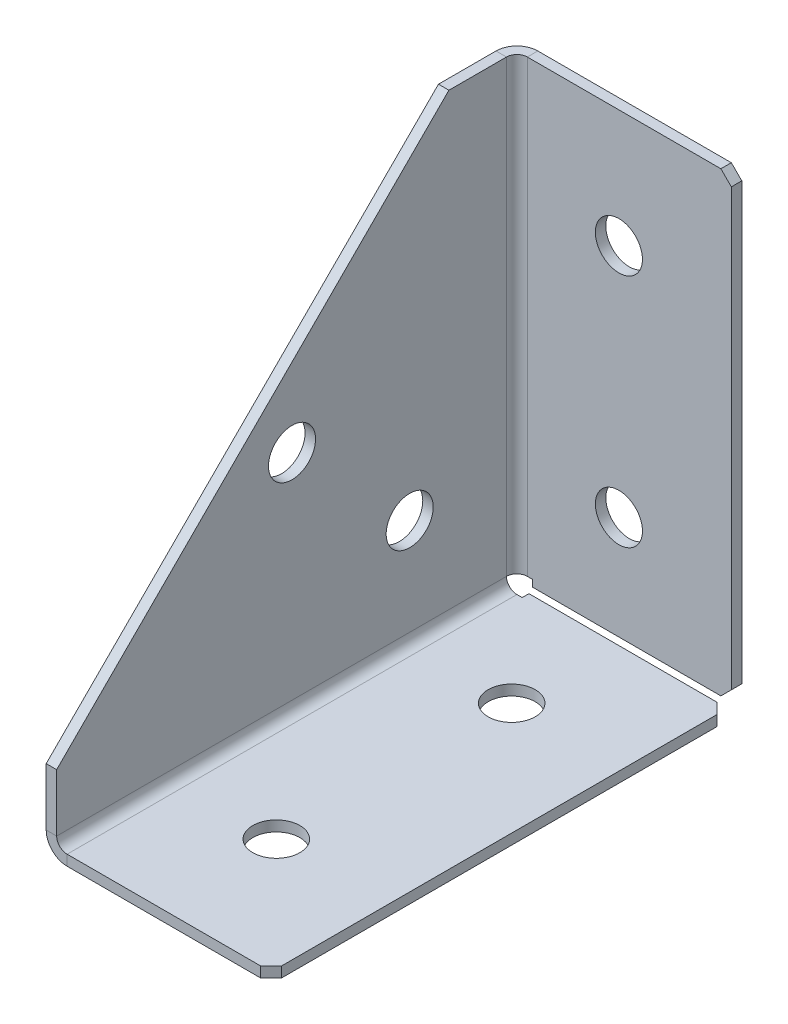
ISO-10303-21;
HEADER;
FILE_DESCRIPTION(('STEP AP214'),'2;1');
FILE_NAME('part.step','',(''),(''),'','','');
FILE_SCHEMA(('AUTOMOTIVE_DESIGN { 1 0 10303 214 1 1 1 1 }'));
ENDSEC;
DATA;
#1=APPLICATION_CONTEXT('core data for automotive mechanical design processes');
#2=APPLICATION_PROTOCOL_DEFINITION('international standard','automotive_design',2000,#1);
#3=PRODUCT_CONTEXT('',#1,'mechanical');
#4=PRODUCT('Part','Part','',(#3));
#5=PRODUCT_RELATED_PRODUCT_CATEGORY('part','',(#4));
#6=PRODUCT_DEFINITION_FORMATION('','',#4);
#7=PRODUCT_DEFINITION_CONTEXT('part definition',#1,'design');
#8=PRODUCT_DEFINITION('design','',#6,#7);
#9=PRODUCT_DEFINITION_SHAPE('','',#8);
#10=(LENGTH_UNIT() NAMED_UNIT(*) SI_UNIT(.MILLI.,.METRE.));
#11=(NAMED_UNIT(*) PLANE_ANGLE_UNIT() SI_UNIT($,.RADIAN.));
#12=(NAMED_UNIT(*) SI_UNIT($,.STERADIAN.) SOLID_ANGLE_UNIT());
#13=UNCERTAINTY_MEASURE_WITH_UNIT(LENGTH_MEASURE(1.E-05),#10,'distance_accuracy_value','');
#14=(GEOMETRIC_REPRESENTATION_CONTEXT(3) GLOBAL_UNCERTAINTY_ASSIGNED_CONTEXT((#13)) GLOBAL_UNIT_ASSIGNED_CONTEXT((#10,
#11,#12)) REPRESENTATION_CONTEXT('',''));
#15=CARTESIAN_POINT('',(0.,0.,0.));
#16=DIRECTION('',(0.,0.,1.));
#17=DIRECTION('',(1.,0.,0.));
#18=AXIS2_PLACEMENT_3D('',#15,#16,#17);
#19=CARTESIAN_POINT('',(4.,4.,3.99999999999998));
#20=DIRECTION('',(0.,0.,1.));
#21=DIRECTION('',(1.,0.,0.));
#22=AXIS2_PLACEMENT_3D('',#19,#20,#21);
#23=PLANE('',#22);
#24=DIRECTION('',(-1.,0.,0.));
#25=VECTOR('',#24,1.);
#26=CARTESIAN_POINT('',(0.,3.99999999999997,3.99999999999997));
#27=LINE('',#26,#25);
#28=CARTESIAN_POINT('',(2.,3.99999999999997,3.99999999999999));
#29=VERTEX_POINT('',#28);
#30=CARTESIAN_POINT('',(0.,3.99999999999997,3.99999999999997));
#31=VERTEX_POINT('',#30);
#32=EDGE_CURVE('E402',#29,#31,#27,.T.);
#33=ORIENTED_EDGE('',*,*,#32,.F.);
#34=CARTESIAN_POINT('',(4.,4.,3.99999999999998));
#35=DIRECTION('',(0.,0.,-1.));
#36=DIRECTION('',(-1.,0.,0.));
#37=AXIS2_PLACEMENT_3D('',#34,#35,#36);
#38=CIRCLE('',#37,2.);
#39=CARTESIAN_POINT('',(4.,2.,3.99999999999998));
#40=VERTEX_POINT('',#39);
#41=EDGE_CURVE('E347',#29,#40,#38,.F.);
#42=ORIENTED_EDGE('',*,*,#41,.T.);
#43=DIRECTION('',(0.,-1.,0.));
#44=VECTOR('',#43,1.);
#45=CARTESIAN_POINT('',(4.,0.,3.99999999999998));
#46=LINE('',#45,#44);
#47=CARTESIAN_POINT('',(4.,0.,3.99999999999998));
#48=VERTEX_POINT('',#47);
#49=EDGE_CURVE('E399',#40,#48,#46,.T.);
#50=ORIENTED_EDGE('',*,*,#49,.T.);
#51=CARTESIAN_POINT('',(4.,4.,3.99999999999998));
#52=DIRECTION('',(0.,0.,-1.));
#53=DIRECTION('',(-1.,0.,0.));
#54=AXIS2_PLACEMENT_3D('',#51,#52,#53);
#55=CIRCLE('',#54,4.);
#56=EDGE_CURVE('E286',#31,#48,#55,.F.);
#57=ORIENTED_EDGE('',*,*,#56,.F.);
#58=EDGE_LOOP('',(#33,#42,#50,#57));
#59=FACE_BOUND('',#58,.T.);
#60=ADVANCED_FACE('F48',(#59),#23,.F.);
#61=CARTESIAN_POINT('',(43.,0.,3.99999999999998));
#62=DIRECTION('',(0.,0.,1.));
#63=DIRECTION('',(1.,0.,0.));
#64=AXIS2_PLACEMENT_3D('',#61,#62,#63);
#65=PLANE('',#64);
#66=ORIENTED_EDGE('',*,*,#49,.F.);
#67=DIRECTION('',(1.,0.,0.));
#68=VECTOR('',#67,1.);
#69=CARTESIAN_POINT('',(43.,2.,3.99999999999998));
#70=LINE('',#69,#68);
#71=CARTESIAN_POINT('',(5.010401,2.,3.99999999999998));
#72=VERTEX_POINT('',#71);
#73=EDGE_CURVE('E317',#40,#72,#70,.T.);
#74=ORIENTED_EDGE('',*,*,#73,.T.);
#75=DIRECTION('',(0.,-1.,0.));
#76=VECTOR('',#75,1.);
#77=CARTESIAN_POINT('',(5.010401,0.,3.99999999999998));
#78=LINE('',#77,#76);
#79=CARTESIAN_POINT('',(5.010401,0.,3.99999999999998));
#80=VERTEX_POINT('',#79);
#81=EDGE_CURVE('E396',#72,#80,#78,.T.);
#82=ORIENTED_EDGE('',*,*,#81,.T.);
#83=DIRECTION('',(1.,0.,0.));
#84=VECTOR('',#83,1.);
#85=CARTESIAN_POINT('',(43.,0.,3.99999999999998));
#86=LINE('',#85,#84);
#87=EDGE_CURVE('E250',#48,#80,#86,.T.);
#88=ORIENTED_EDGE('',*,*,#87,.F.);
#89=EDGE_LOOP('',(#66,#74,#82,#88));
#90=FACE_BOUND('',#89,.T.);
#91=ADVANCED_FACE('F520',(#90),#65,.F.);
#92=CARTESIAN_POINT('',(5.010401,0.,90.));
#93=DIRECTION('',(-1.,0.,0.));
#94=DIRECTION('',(0.,0.,1.));
#95=AXIS2_PLACEMENT_3D('',#92,#93,#94);
#96=PLANE('',#95);
#97=ORIENTED_EDGE('',*,*,#81,.F.);
#98=DIRECTION('',(0.,0.,1.));
#99=VECTOR('',#98,1.);
#100=CARTESIAN_POINT('',(5.010401,2.,90.));
#101=LINE('',#100,#99);
#102=CARTESIAN_POINT('',(5.010401,2.,2.70710678118655));
#103=VERTEX_POINT('',#102);
#104=EDGE_CURVE('E357',#103,#72,#101,.T.);
#105=ORIENTED_EDGE('',*,*,#104,.F.);
#106=DIRECTION('',(0.,-1.,0.));
#107=VECTOR('',#106,1.);
#108=CARTESIAN_POINT('',(5.010401,0.,2.70710678118655));
#109=LINE('',#108,#107);
#110=CARTESIAN_POINT('',(5.010401,0.,2.70710678118655));
#111=VERTEX_POINT('',#110);
#112=EDGE_CURVE('E393',#103,#111,#109,.T.);
#113=ORIENTED_EDGE('',*,*,#112,.T.);
#114=DIRECTION('',(0.,0.,1.));
#115=VECTOR('',#114,1.);
#116=CARTESIAN_POINT('',(5.010401,0.,90.));
#117=LINE('',#116,#115);
#118=EDGE_CURVE('E246',#111,#80,#117,.T.);
#119=ORIENTED_EDGE('',*,*,#118,.T.);
#120=EDGE_LOOP('',(#97,#105,#113,#119));
#121=FACE_BOUND('',#120,.T.);
#122=ADVANCED_FACE('F525',(#121),#96,.T.);
#123=CARTESIAN_POINT('',(43.,0.,2.70710678118655));
#124=DIRECTION('',(0.,0.,1.));
#125=DIRECTION('',(1.,0.,0.));
#126=AXIS2_PLACEMENT_3D('',#123,#124,#125);
#127=PLANE('',#126);
#128=DIRECTION('',(1.,0.,0.));
#129=VECTOR('',#128,1.);
#130=CARTESIAN_POINT('',(43.,2.,2.70710678118655));
#131=LINE('',#130,#129);
#132=CARTESIAN_POINT('',(41.,2.,2.70710678118655));
#133=VERTEX_POINT('',#132);
#134=EDGE_CURVE('E321',#103,#133,#131,.T.);
#135=ORIENTED_EDGE('',*,*,#134,.T.);
#136=DIRECTION('',(0.,1.,0.));
#137=VECTOR('',#136,1.);
#138=CARTESIAN_POINT('',(41.,0.,2.70710678118655));
#139=LINE('',#138,#137);
#140=CARTESIAN_POINT('',(41.,0.,2.70710678118655));
#141=VERTEX_POINT('',#140);
#142=EDGE_CURVE('E429',#133,#141,#139,.F.);
#143=ORIENTED_EDGE('',*,*,#142,.T.);
#144=DIRECTION('',(1.,0.,0.));
#145=VECTOR('',#144,1.);
#146=CARTESIAN_POINT('',(43.,0.,2.70710678118655));
#147=LINE('',#146,#145);
#148=EDGE_CURVE('E242',#111,#141,#147,.T.);
#149=ORIENTED_EDGE('',*,*,#148,.F.);
#150=ORIENTED_EDGE('',*,*,#112,.F.);
#151=EDGE_LOOP('',(#135,#143,#149,#150));
#152=FACE_BOUND('',#151,.T.);
#153=ADVANCED_FACE('F562',(#152),#127,.F.);
#154=CARTESIAN_POINT('',(43.,0.,90.));
#155=DIRECTION('',(1.,0.,0.));
#156=DIRECTION('',(0.,0.,-1.));
#157=AXIS2_PLACEMENT_3D('',#154,#155,#156);
#158=PLANE('',#157);
#159=DIRECTION('',(0.,0.,1.));
#160=VECTOR('',#159,1.);
#161=CARTESIAN_POINT('',(43.,2.,90.));
#162=LINE('',#161,#160);
#163=CARTESIAN_POINT('',(43.,2.,88.));
#164=VERTEX_POINT('',#163);
#165=CARTESIAN_POINT('',(43.,2.,4.70710678118656));
#166=VERTEX_POINT('',#165);
#167=EDGE_CURVE('E350',#164,#166,#162,.F.);
#168=ORIENTED_EDGE('',*,*,#167,.F.);
#169=DIRECTION('',(0.,-1.,0.));
#170=VECTOR('',#169,1.);
#171=CARTESIAN_POINT('',(43.,0.,88.));
#172=LINE('',#171,#170);
#173=CARTESIAN_POINT('',(43.,0.,88.));
#174=VERTEX_POINT('',#173);
#175=EDGE_CURVE('E410',#164,#174,#172,.T.);
#176=ORIENTED_EDGE('',*,*,#175,.T.);
#177=DIRECTION('',(0.,0.,-1.));
#178=VECTOR('',#177,1.);
#179=CARTESIAN_POINT('',(43.,0.,90.));
#180=LINE('',#179,#178);
#181=CARTESIAN_POINT('',(43.,0.,4.70710678118659));
#182=VERTEX_POINT('',#181);
#183=EDGE_CURVE('E279',#174,#182,#180,.T.);
#184=ORIENTED_EDGE('',*,*,#183,.T.);
#185=DIRECTION('',(0.,1.,0.));
#186=VECTOR('',#185,1.);
#187=CARTESIAN_POINT('',(43.,0.,4.70710678118656));
#188=LINE('',#187,#186);
#189=EDGE_CURVE('E405',#182,#166,#188,.T.);
#190=ORIENTED_EDGE('',*,*,#189,.T.);
#191=EDGE_LOOP('',(#168,#176,#184,#190));
#192=FACE_BOUND('',#191,.T.);
#193=ADVANCED_FACE('F576',(#192),#158,.T.);
#194=CARTESIAN_POINT('',(43.,0.,90.));
#195=DIRECTION('',(0.,0.,-1.));
#196=DIRECTION('',(-1.,0.,0.));
#197=AXIS2_PLACEMENT_3D('',#194,#195,#196);
#198=PLANE('',#197);
#199=DIRECTION('',(-1.,0.,0.));
#200=VECTOR('',#199,1.);
#201=CARTESIAN_POINT('',(43.,0.,90.));
#202=LINE('',#201,#200);
#203=CARTESIAN_POINT('',(41.,0.,90.));
#204=VERTEX_POINT('',#203);
#205=CARTESIAN_POINT('',(4.,0.,90.));
#206=VERTEX_POINT('',#205);
#207=EDGE_CURVE('E220',#204,#206,#202,.T.);
#208=ORIENTED_EDGE('',*,*,#207,.F.);
#209=DIRECTION('',(0.,-1.,0.));
#210=VECTOR('',#209,1.);
#211=CARTESIAN_POINT('',(41.,0.,90.));
#212=LINE('',#211,#210);
#213=CARTESIAN_POINT('',(41.,2.,90.));
#214=VERTEX_POINT('',#213);
#215=EDGE_CURVE('E420',#204,#214,#212,.F.);
#216=ORIENTED_EDGE('',*,*,#215,.T.);
#217=DIRECTION('',(1.,0.,0.));
#218=VECTOR('',#217,1.);
#219=CARTESIAN_POINT('',(43.,2.,90.));
#220=LINE('',#219,#218);
#221=CARTESIAN_POINT('',(4.,2.,90.));
#222=VERTEX_POINT('',#221);
#223=EDGE_CURVE('E343',#214,#222,#220,.F.);
#224=ORIENTED_EDGE('',*,*,#223,.T.);
#225=DIRECTION('',(0.,-1.,0.));
#226=VECTOR('',#225,1.);
#227=CARTESIAN_POINT('',(4.,0.,90.));
#228=LINE('',#227,#226);
#229=EDGE_CURVE('E389',#222,#206,#228,.T.);
#230=ORIENTED_EDGE('',*,*,#229,.T.);
#231=EDGE_LOOP('',(#208,#216,#224,#230));
#232=FACE_BOUND('',#231,.T.);
#233=ADVANCED_FACE('F714',(#232),#198,.F.);
#234=CARTESIAN_POINT('',(4.,4.,90.));
#235=DIRECTION('',(0.,0.,1.));
#236=DIRECTION('',(1.,0.,0.));
#237=AXIS2_PLACEMENT_3D('',#234,#235,#236);
#238=PLANE('',#237);
#239=ORIENTED_EDGE('',*,*,#229,.F.);
#240=CARTESIAN_POINT('',(4.,4.,90.));
#241=DIRECTION('',(0.,0.,-1.));
#242=DIRECTION('',(-1.,0.,0.));
#243=AXIS2_PLACEMENT_3D('',#240,#241,#242);
#244=CIRCLE('',#243,2.);
#245=CARTESIAN_POINT('',(2.,4.,90.));
#246=VERTEX_POINT('',#245);
#247=EDGE_CURVE('E334',#222,#246,#244,.T.);
#248=ORIENTED_EDGE('',*,*,#247,.T.);
#249=DIRECTION('',(-1.,0.,0.));
#250=VECTOR('',#249,1.);
#251=CARTESIAN_POINT('',(0.,4.,90.));
#252=LINE('',#251,#250);
#253=CARTESIAN_POINT('',(0.,4.,90.));
#254=VERTEX_POINT('',#253);
#255=EDGE_CURVE('E207',#246,#254,#252,.T.);
#256=ORIENTED_EDGE('',*,*,#255,.T.);
#257=CARTESIAN_POINT('',(4.,4.,90.));
#258=DIRECTION('',(0.,0.,-1.));
#259=DIRECTION('',(-1.,0.,0.));
#260=AXIS2_PLACEMENT_3D('',#257,#258,#259);
#261=CIRCLE('',#260,4.);
#262=EDGE_CURVE('E275',#206,#254,#261,.T.);
#263=ORIENTED_EDGE('',*,*,#262,.F.);
#264=EDGE_LOOP('',(#239,#248,#256,#263));
#265=FACE_BOUND('',#264,.T.);
#266=ADVANCED_FACE('F493',(#265),#238,.T.);
#267=CARTESIAN_POINT('',(0.,15.,90.));
#268=DIRECTION('',(0.,0.,1.));
#269=DIRECTION('',(0.,-1.,0.));
#270=AXIS2_PLACEMENT_3D('',#267,#268,#269);
#271=PLANE('',#270);
#272=ORIENTED_EDGE('',*,*,#255,.F.);
#273=DIRECTION('',(0.,1.,0.));
#274=VECTOR('',#273,1.);
#275=CARTESIAN_POINT('',(2.,0.,90.));
#276=LINE('',#275,#274);
#277=CARTESIAN_POINT('',(2.,15.,90.));
#278=VERTEX_POINT('',#277);
#279=EDGE_CURVE('E201',#278,#246,#276,.F.);
#280=ORIENTED_EDGE('',*,*,#279,.F.);
#281=DIRECTION('',(-1.,0.,0.));
#282=VECTOR('',#281,1.);
#283=CARTESIAN_POINT('',(0.,15.,90.));
#284=LINE('',#283,#282);
#285=CARTESIAN_POINT('',(0.,15.,90.));
#286=VERTEX_POINT('',#285);
#287=EDGE_CURVE('E195',#278,#286,#284,.T.);
#288=ORIENTED_EDGE('',*,*,#287,.T.);
#289=DIRECTION('',(0.,-1.,0.));
#290=VECTOR('',#289,1.);
#291=CARTESIAN_POINT('',(0.,15.,90.));
#292=LINE('',#291,#290);
#293=EDGE_CURVE('E198',#286,#254,#292,.T.);
#294=ORIENTED_EDGE('',*,*,#293,.T.);
#295=EDGE_LOOP('',(#272,#280,#288,#294));
#296=FACE_BOUND('',#295,.T.);
#297=ADVANCED_FACE('F197',(#296),#271,.T.);
#298=CARTESIAN_POINT('',(0.,90.,15.));
#299=DIRECTION('',(0.,0.707106781186548,0.707106781186548));
#300=DIRECTION('',(0.,-0.707106781186548,0.707106781186548));
#301=AXIS2_PLACEMENT_3D('',#298,#299,#300);
#302=PLANE('',#301);
#303=ORIENTED_EDGE('',*,*,#287,.F.);
#304=DIRECTION('',(0.,-0.707106781186548,0.707106781186548));
#305=VECTOR('',#304,1.);
#306=CARTESIAN_POINT('',(2.,90.,15.));
#307=LINE('',#306,#305);
#308=CARTESIAN_POINT('',(2.,90.,15.));
#309=VERTEX_POINT('',#308);
#310=EDGE_CURVE('E338',#309,#278,#307,.T.);
#311=ORIENTED_EDGE('',*,*,#310,.F.);
#312=DIRECTION('',(-1.,0.,0.));
#313=VECTOR('',#312,1.);
#314=CARTESIAN_POINT('',(0.,90.,15.));
#315=LINE('',#314,#313);
#316=CARTESIAN_POINT('',(0.,90.,15.));
#317=VERTEX_POINT('',#316);
#318=EDGE_CURVE('E208',#309,#317,#315,.T.);
#319=ORIENTED_EDGE('',*,*,#318,.T.);
#320=DIRECTION('',(0.,-0.707106781186548,0.707106781186548));
#321=VECTOR('',#320,1.);
#322=CARTESIAN_POINT('',(0.,90.,15.));
#323=LINE('',#322,#321);
#324=EDGE_CURVE('E215',#317,#286,#323,.T.);
#325=ORIENTED_EDGE('',*,*,#324,.T.);
#326=EDGE_LOOP('',(#303,#311,#319,#325));
#327=FACE_BOUND('',#326,.T.);
#328=ADVANCED_FACE('F222',(#327),#302,.T.);
#329=CARTESIAN_POINT('',(0.,90.,0.));
#330=DIRECTION('',(0.,1.,0.));
#331=DIRECTION('',(0.,0.,1.));
#332=AXIS2_PLACEMENT_3D('',#329,#330,#331);
#333=PLANE('',#332);
#334=ORIENTED_EDGE('',*,*,#318,.F.);
#335=DIRECTION('',(0.,0.,-1.));
#336=VECTOR('',#335,1.);
#337=CARTESIAN_POINT('',(2.,90.,0.));
#338=LINE('',#337,#336);
#339=CARTESIAN_POINT('',(2.,90.,4.));
#340=VERTEX_POINT('',#339);
#341=EDGE_CURVE('E328',#340,#309,#338,.F.);
#342=ORIENTED_EDGE('',*,*,#341,.F.);
#343=DIRECTION('',(-1.,0.,0.));
#344=VECTOR('',#343,1.);
#345=CARTESIAN_POINT('',(0.,90.,4.));
#346=LINE('',#345,#344);
#347=CARTESIAN_POINT('',(0.,90.,4.));
#348=VERTEX_POINT('',#347);
#349=EDGE_CURVE('E382',#340,#348,#346,.T.);
#350=ORIENTED_EDGE('',*,*,#349,.T.);
#351=DIRECTION('',(0.,0.,1.));
#352=VECTOR('',#351,1.);
#353=CARTESIAN_POINT('',(0.,90.,0.));
#354=LINE('',#353,#352);
#355=EDGE_CURVE('E224',#348,#317,#354,.T.);
#356=ORIENTED_EDGE('',*,*,#355,.T.);
#357=EDGE_LOOP('',(#334,#342,#350,#356));
#358=FACE_BOUND('',#357,.T.);
#359=ADVANCED_FACE('F505',(#358),#333,.T.);
#360=CARTESIAN_POINT('',(4.,90.,4.));
#361=DIRECTION('',(0.,-1.,0.));
#362=DIRECTION('',(0.,0.,-1.));
#363=AXIS2_PLACEMENT_3D('',#360,#361,#362);
#364=PLANE('',#363);
#365=ORIENTED_EDGE('',*,*,#349,.F.);
#366=CARTESIAN_POINT('',(4.,90.,4.));
#367=DIRECTION('',(0.,1.,0.));
#368=DIRECTION('',(0.,0.,1.));
#369=AXIS2_PLACEMENT_3D('',#366,#367,#368);
#370=CIRCLE('',#369,2.);
#371=CARTESIAN_POINT('',(4.,90.,2.));
#372=VERTEX_POINT('',#371);
#373=EDGE_CURVE('E329',#340,#372,#370,.F.);
#374=ORIENTED_EDGE('',*,*,#373,.T.);
#375=DIRECTION('',(0.,0.,-1.));
#376=VECTOR('',#375,1.);
#377=CARTESIAN_POINT('',(4.,90.,0.));
#378=LINE('',#377,#376);
#379=CARTESIAN_POINT('',(4.,90.,0.));
#380=VERTEX_POINT('',#379);
#381=EDGE_CURVE('E378',#372,#380,#378,.T.);
#382=ORIENTED_EDGE('',*,*,#381,.T.);
#383=CARTESIAN_POINT('',(4.,90.,4.));
#384=DIRECTION('',(0.,1.,0.));
#385=DIRECTION('',(0.,0.,1.));
#386=AXIS2_PLACEMENT_3D('',#383,#384,#385);
#387=CIRCLE('',#386,4.);
#388=EDGE_CURVE('E270',#348,#380,#387,.F.);
#389=ORIENTED_EDGE('',*,*,#388,.F.);
#390=EDGE_LOOP('',(#365,#374,#382,#389));
#391=FACE_BOUND('',#390,.T.);
#392=ADVANCED_FACE('F507',(#391),#364,.F.);
#393=CARTESIAN_POINT('',(43.,90.,0.));
#394=DIRECTION('',(0.,1.,0.));
#395=DIRECTION('',(-1.,0.,0.));
#396=AXIS2_PLACEMENT_3D('',#393,#394,#395);
#397=PLANE('',#396);
#398=DIRECTION('',(1.,0.,0.));
#399=VECTOR('',#398,1.);
#400=CARTESIAN_POINT('',(43.,90.,2.));
#401=LINE('',#400,#399);
#402=CARTESIAN_POINT('',(41.,90.,2.));
#403=VERTEX_POINT('',#402);
#404=EDGE_CURVE('E325',#403,#372,#401,.F.);
#405=ORIENTED_EDGE('',*,*,#404,.F.);
#406=DIRECTION('',(0.,0.,-1.));
#407=VECTOR('',#406,1.);
#408=CARTESIAN_POINT('',(41.,90.,0.));
#409=LINE('',#408,#407);
#410=CARTESIAN_POINT('',(41.,90.,0.));
#411=VERTEX_POINT('',#410);
#412=EDGE_CURVE('E11',#403,#411,#409,.T.);
#413=ORIENTED_EDGE('',*,*,#412,.T.);
#414=DIRECTION('',(-1.,0.,0.));
#415=VECTOR('',#414,1.);
#416=CARTESIAN_POINT('',(43.,90.,0.));
#417=LINE('',#416,#415);
#418=EDGE_CURVE('E229',#411,#380,#417,.T.);
#419=ORIENTED_EDGE('',*,*,#418,.T.);
#420=ORIENTED_EDGE('',*,*,#381,.F.);
#421=EDGE_LOOP('',(#405,#413,#419,#420));
#422=FACE_BOUND('',#421,.T.);
#423=ADVANCED_FACE('F511',(#422),#397,.T.);
#424=CARTESIAN_POINT('',(43.,0.,0.));
#425=DIRECTION('',(1.,0.,0.));
#426=DIRECTION('',(0.,1.,0.));
#427=AXIS2_PLACEMENT_3D('',#424,#425,#426);
#428=PLANE('',#427);
#429=DIRECTION('',(0.,1.,0.));
#430=VECTOR('',#429,1.);
#431=CARTESIAN_POINT('',(43.,0.,2.));
#432=LINE('',#431,#430);
#433=CARTESIAN_POINT('',(43.,4.70710678118654,2.));
#434=VERTEX_POINT('',#433);
#435=CARTESIAN_POINT('',(43.,88.,2.));
#436=VERTEX_POINT('',#435);
#437=EDGE_CURVE('E322',#434,#436,#432,.T.);
#438=ORIENTED_EDGE('',*,*,#437,.F.);
#439=DIRECTION('',(0.,0.,-1.));
#440=VECTOR('',#439,1.);
#441=CARTESIAN_POINT('',(43.,4.70710678118654,0.));
#442=LINE('',#441,#440);
#443=CARTESIAN_POINT('',(43.,4.70710678118653,0.));
#444=VERTEX_POINT('',#443);
#445=EDGE_CURVE('E436',#434,#444,#442,.T.);
#446=ORIENTED_EDGE('',*,*,#445,.T.);
#447=DIRECTION('',(0.,1.,0.));
#448=VECTOR('',#447,1.);
#449=CARTESIAN_POINT('',(43.,0.,0.));
#450=LINE('',#449,#448);
#451=CARTESIAN_POINT('',(43.,88.,0.));
#452=VERTEX_POINT('',#451);
#453=EDGE_CURVE('E235',#444,#452,#450,.T.);
#454=ORIENTED_EDGE('',*,*,#453,.T.);
#455=DIRECTION('',(0.,0.,1.));
#456=VECTOR('',#455,1.);
#457=CARTESIAN_POINT('',(43.,88.,0.));
#458=LINE('',#457,#456);
#459=EDGE_CURVE('E433',#452,#436,#458,.T.);
#460=ORIENTED_EDGE('',*,*,#459,.T.);
#461=EDGE_LOOP('',(#438,#446,#454,#460));
#462=FACE_BOUND('',#461,.T.);
#463=ADVANCED_FACE('F458',(#462),#428,.T.);
#464=CARTESIAN_POINT('',(43.,2.70710678118655,0.));
#465=DIRECTION('',(0.,1.,0.));
#466=DIRECTION('',(-1.,0.,0.));
#467=AXIS2_PLACEMENT_3D('',#464,#465,#466);
#468=PLANE('',#467);
#469=DIRECTION('',(-1.,0.,0.));
#470=VECTOR('',#469,1.);
#471=CARTESIAN_POINT('',(43.,2.70710678118655,0.));
#472=LINE('',#471,#470);
#473=CARTESIAN_POINT('',(41.,2.70710678118655,0.));
#474=VERTEX_POINT('',#473);
#475=CARTESIAN_POINT('',(5.010401,2.70710678118655,0.));
#476=VERTEX_POINT('',#475);
#477=EDGE_CURVE('E239',#474,#476,#472,.T.);
#478=ORIENTED_EDGE('',*,*,#477,.F.);
#479=DIRECTION('',(0.,0.,-1.));
#480=VECTOR('',#479,1.);
#481=CARTESIAN_POINT('',(41.,2.70710678118655,0.));
#482=LINE('',#481,#480);
#483=CARTESIAN_POINT('',(41.,2.70710678118655,2.));
#484=VERTEX_POINT('',#483);
#485=EDGE_CURVE('E73',#474,#484,#482,.F.);
#486=ORIENTED_EDGE('',*,*,#485,.T.);
#487=DIRECTION('',(1.,0.,0.));
#488=VECTOR('',#487,1.);
#489=CARTESIAN_POINT('',(43.,2.70710678118655,2.));
#490=LINE('',#489,#488);
#491=CARTESIAN_POINT('',(5.010401,2.70710678118655,2.));
#492=VERTEX_POINT('',#491);
#493=EDGE_CURVE('E318',#484,#492,#490,.F.);
#494=ORIENTED_EDGE('',*,*,#493,.T.);
#495=DIRECTION('',(0.,0.,-1.));
#496=VECTOR('',#495,1.);
#497=CARTESIAN_POINT('',(5.010401,2.70710678118655,0.));
#498=LINE('',#497,#496);
#499=EDGE_CURVE('E374',#492,#476,#498,.T.);
#500=ORIENTED_EDGE('',*,*,#499,.T.);
#501=EDGE_LOOP('',(#478,#486,#494,#500));
#502=FACE_BOUND('',#501,.T.);
#503=ADVANCED_FACE('F465',(#502),#468,.F.);
#504=CARTESIAN_POINT('',(5.010401,0.,0.));
#505=DIRECTION('',(-1.,0.,0.));
#506=DIRECTION('',(0.,-1.,0.));
#507=AXIS2_PLACEMENT_3D('',#504,#505,#506);
#508=PLANE('',#507);
#509=ORIENTED_EDGE('',*,*,#499,.F.);
#510=DIRECTION('',(0.,1.,0.));
#511=VECTOR('',#510,1.);
#512=CARTESIAN_POINT('',(5.010401,0.,2.));
#513=LINE('',#512,#511);
#514=CARTESIAN_POINT('',(5.010401,3.99999999999997,2.));
#515=VERTEX_POINT('',#514);
#516=EDGE_CURVE('E313',#515,#492,#513,.F.);
#517=ORIENTED_EDGE('',*,*,#516,.F.);
#518=DIRECTION('',(0.,0.,-1.));
#519=VECTOR('',#518,1.);
#520=CARTESIAN_POINT('',(5.010401,3.99999999999997,0.));
#521=LINE('',#520,#519);
#522=CARTESIAN_POINT('',(5.010401,3.99999999999997,0.));
#523=VERTEX_POINT('',#522);
#524=EDGE_CURVE('E371',#515,#523,#521,.T.);
#525=ORIENTED_EDGE('',*,*,#524,.T.);
#526=DIRECTION('',(0.,-1.,0.));
#527=VECTOR('',#526,1.);
#528=CARTESIAN_POINT('',(5.010401,0.,0.));
#529=LINE('',#528,#527);
#530=EDGE_CURVE('E254',#523,#476,#529,.T.);
#531=ORIENTED_EDGE('',*,*,#530,.T.);
#532=EDGE_LOOP('',(#509,#517,#525,#531));
#533=FACE_BOUND('',#532,.T.);
#534=ADVANCED_FACE('F469',(#533),#508,.T.);
#535=CARTESIAN_POINT('',(43.,3.99999999999997,0.));
#536=DIRECTION('',(0.,1.,0.));
#537=DIRECTION('',(-1.,0.,0.));
#538=AXIS2_PLACEMENT_3D('',#535,#536,#537);
#539=PLANE('',#538);
#540=ORIENTED_EDGE('',*,*,#524,.F.);
#541=DIRECTION('',(1.,0.,0.));
#542=VECTOR('',#541,1.);
#543=CARTESIAN_POINT('',(43.,3.99999999999997,2.));
#544=LINE('',#543,#542);
#545=CARTESIAN_POINT('',(4.,3.99999999999997,2.));
#546=VERTEX_POINT('',#545);
#547=EDGE_CURVE('E299',#515,#546,#544,.F.);
#548=ORIENTED_EDGE('',*,*,#547,.T.);
#549=DIRECTION('',(0.,0.,-1.));
#550=VECTOR('',#549,1.);
#551=CARTESIAN_POINT('',(4.,3.99999999999997,0.));
#552=LINE('',#551,#550);
#553=CARTESIAN_POINT('',(4.,3.99999999999997,0.));
#554=VERTEX_POINT('',#553);
#555=EDGE_CURVE('E285',#546,#554,#552,.T.);
#556=ORIENTED_EDGE('',*,*,#555,.T.);
#557=DIRECTION('',(-1.,0.,0.));
#558=VECTOR('',#557,1.);
#559=CARTESIAN_POINT('',(43.,3.99999999999997,0.));
#560=LINE('',#559,#558);
#561=EDGE_CURVE('E258',#523,#554,#560,.T.);
#562=ORIENTED_EDGE('',*,*,#561,.F.);
#563=EDGE_LOOP('',(#540,#548,#556,#562));
#564=FACE_BOUND('',#563,.T.);
#565=ADVANCED_FACE('F473',(#564),#539,.F.);
#566=CARTESIAN_POINT('',(4.,3.99999999999997,4.));
#567=DIRECTION('',(0.,1.,0.));
#568=DIRECTION('',(0.,0.,1.));
#569=AXIS2_PLACEMENT_3D('',#566,#567,#568);
#570=PLANE('',#569);
#571=CARTESIAN_POINT('',(4.,3.99999999999997,4.));
#572=DIRECTION('',(0.,1.,0.));
#573=DIRECTION('',(0.,0.,1.));
#574=AXIS2_PLACEMENT_3D('',#571,#572,#573);
#575=CIRCLE('',#574,2.);
#576=EDGE_CURVE('E333',#546,#29,#575,.T.);
#577=ORIENTED_EDGE('',*,*,#576,.T.);
#578=ORIENTED_EDGE('',*,*,#32,.T.);
#579=CARTESIAN_POINT('',(4.,3.99999999999997,4.));
#580=DIRECTION('',(0.,-1.,0.));
#581=DIRECTION('',(0.,0.,-1.));
#582=AXIS2_PLACEMENT_3D('',#579,#580,#581);
#583=CIRCLE('',#582,4.);
#584=EDGE_CURVE('E274',#554,#31,#583,.F.);
#585=ORIENTED_EDGE('',*,*,#584,.F.);
#586=ORIENTED_EDGE('',*,*,#555,.F.);
#587=EDGE_LOOP('',(#577,#578,#585,#586));
#588=FACE_BOUND('',#587,.T.);
#589=ADVANCED_FACE('F478',(#588),#570,.F.);
#590=CARTESIAN_POINT('',(43.,0.,0.));
#591=DIRECTION('',(0.,0.,1.));
#592=DIRECTION('',(1.,0.,0.));
#593=AXIS2_PLACEMENT_3D('',#590,#591,#592);
#594=PLANE('',#593);
#595=CARTESIAN_POINT('',(21.5,67.5,0.));
#596=DIRECTION('',(0.,0.,1.));
#597=DIRECTION('',(1.,0.,0.));
#598=AXIS2_PLACEMENT_3D('',#595,#596,#597);
#599=CIRCLE('',#598,4.5);
#600=CARTESIAN_POINT('',(26.,67.5,0.));
#601=VERTEX_POINT('',#600);
#602=EDGE_CURVE('E591',#601,#601,#599,.T.);
#603=ORIENTED_EDGE('',*,*,#602,.T.);
#604=EDGE_LOOP('',(#603));
#605=FACE_BOUND('',#604,.T.);
#606=CARTESIAN_POINT('',(21.5,22.5,0.));
#607=DIRECTION('',(0.,0.,1.));
#608=DIRECTION('',(1.,0.,0.));
#609=AXIS2_PLACEMENT_3D('',#606,#607,#608);
#610=CIRCLE('',#609,4.5);
#611=CARTESIAN_POINT('',(26.,22.5,0.));
#612=VERTEX_POINT('',#611);
#613=EDGE_CURVE('E367',#612,#612,#610,.T.);
#614=ORIENTED_EDGE('',*,*,#613,.T.);
#615=EDGE_LOOP('',(#614));
#616=FACE_BOUND('',#615,.T.);
#617=ORIENTED_EDGE('',*,*,#453,.F.);
#618=DIRECTION('',(-0.70710678118655,-0.707106781186545,0.));
#619=VECTOR('',#618,1.);
#620=CARTESIAN_POINT('',(43.,4.70710678118654,0.));
#621=LINE('',#620,#619);
#622=EDGE_CURVE('E443',#444,#474,#621,.T.);
#623=ORIENTED_EDGE('',*,*,#622,.T.);
#624=ORIENTED_EDGE('',*,*,#477,.T.);
#625=ORIENTED_EDGE('',*,*,#530,.F.);
#626=ORIENTED_EDGE('',*,*,#561,.T.);
#627=DIRECTION('',(0.,1.,0.));
#628=VECTOR('',#627,1.);
#629=CARTESIAN_POINT('',(4.,0.,0.));
#630=LINE('',#629,#628);
#631=EDGE_CURVE('E262',#554,#380,#630,.T.);
#632=ORIENTED_EDGE('',*,*,#631,.T.);
#633=ORIENTED_EDGE('',*,*,#418,.F.);
#634=DIRECTION('',(-0.707106781186545,0.70710678118655,0.));
#635=VECTOR('',#634,1.);
#636=CARTESIAN_POINT('',(41.,90.,0.));
#637=LINE('',#636,#635);
#638=EDGE_CURVE('E440',#411,#452,#637,.F.);
#639=ORIENTED_EDGE('',*,*,#638,.T.);
#640=EDGE_LOOP('',(#617,#623,#624,#625,#626,#632,#633,#639));
#641=FACE_BOUND('',#640,.T.);
#642=ADVANCED_FACE('F463',(#605,#616,#641),#594,.F.);
#643=CARTESIAN_POINT('',(0.,0.,0.));
#644=DIRECTION('',(1.,0.,0.));
#645=DIRECTION('',(0.,0.,-1.));
#646=AXIS2_PLACEMENT_3D('',#643,#644,#645);
#647=PLANE('',#646);
#648=CARTESIAN_POINT('',(0.,45.,45.));
#649=DIRECTION('',(1.,0.,0.));
#650=DIRECTION('',(0.,0.,-1.));
#651=AXIS2_PLACEMENT_3D('',#648,#649,#650);
#652=CIRCLE('',#651,4.5);
#653=CARTESIAN_POINT('',(0.,45.,40.5));
#654=VERTEX_POINT('',#653);
#655=EDGE_CURVE('E620',#654,#654,#652,.T.);
#656=ORIENTED_EDGE('',*,*,#655,.T.);
#657=EDGE_LOOP('',(#656));
#658=FACE_BOUND('',#657,.T.);
#659=CARTESIAN_POINT('',(0.,22.5,22.5));
#660=DIRECTION('',(1.,0.,0.));
#661=DIRECTION('',(0.,0.,-1.));
#662=AXIS2_PLACEMENT_3D('',#659,#660,#661);
#663=CIRCLE('',#662,4.5);
#664=CARTESIAN_POINT('',(0.,22.5,18.));
#665=VERTEX_POINT('',#664);
#666=EDGE_CURVE('E615',#665,#665,#663,.T.);
#667=ORIENTED_EDGE('',*,*,#666,.T.);
#668=EDGE_LOOP('',(#667));
#669=FACE_BOUND('',#668,.T.);
#670=DIRECTION('',(0.,1.,0.));
#671=VECTOR('',#670,1.);
#672=CARTESIAN_POINT('',(0.,0.,4.));
#673=LINE('',#672,#671);
#674=EDGE_CURVE('E266',#348,#31,#673,.F.);
#675=ORIENTED_EDGE('',*,*,#674,.T.);
#676=DIRECTION('',(0.,0.,-1.));
#677=VECTOR('',#676,1.);
#678=CARTESIAN_POINT('',(0.,4.,0.));
#679=LINE('',#678,#677);
#680=EDGE_CURVE('E218',#31,#254,#679,.F.);
#681=ORIENTED_EDGE('',*,*,#680,.T.);
#682=ORIENTED_EDGE('',*,*,#293,.F.);
#683=ORIENTED_EDGE('',*,*,#324,.F.);
#684=ORIENTED_EDGE('',*,*,#355,.F.);
#685=EDGE_LOOP('',(#675,#681,#682,#683,#684));
#686=FACE_BOUND('',#685,.T.);
#687=ADVANCED_FACE('F213',(#658,#669,#686),#647,.F.);
#688=CARTESIAN_POINT('',(43.,0.,90.));
#689=DIRECTION('',(0.,1.,0.));
#690=DIRECTION('',(0.,0.,1.));
#691=AXIS2_PLACEMENT_3D('',#688,#689,#690);
#692=PLANE('',#691);
#693=CARTESIAN_POINT('',(21.5,0.,67.5));
#694=DIRECTION('',(0.,1.,0.));
#695=DIRECTION('',(0.,0.,1.));
#696=AXIS2_PLACEMENT_3D('',#693,#694,#695);
#697=CIRCLE('',#696,4.5);
#698=CARTESIAN_POINT('',(21.5,0.,72.));
#699=VERTEX_POINT('',#698);
#700=EDGE_CURVE('E607',#699,#699,#697,.T.);
#701=ORIENTED_EDGE('',*,*,#700,.T.);
#702=EDGE_LOOP('',(#701));
#703=FACE_BOUND('',#702,.T.);
#704=CARTESIAN_POINT('',(21.5,0.,22.5));
#705=DIRECTION('',(0.,1.,0.));
#706=DIRECTION('',(0.,0.,1.));
#707=AXIS2_PLACEMENT_3D('',#704,#705,#706);
#708=CIRCLE('',#707,4.5);
#709=CARTESIAN_POINT('',(21.5,0.,27.));
#710=VERTEX_POINT('',#709);
#711=EDGE_CURVE('E599',#710,#710,#708,.T.);
#712=ORIENTED_EDGE('',*,*,#711,.T.);
#713=EDGE_LOOP('',(#712));
#714=FACE_BOUND('',#713,.T.);
#715=ORIENTED_EDGE('',*,*,#183,.F.);
#716=DIRECTION('',(-0.70710678118655,0.,0.707106781186545));
#717=VECTOR('',#716,1.);
#718=CARTESIAN_POINT('',(43.,0.,88.));
#719=LINE('',#718,#717);
#720=EDGE_CURVE('E417',#174,#204,#719,.T.);
#721=ORIENTED_EDGE('',*,*,#720,.T.);
#722=ORIENTED_EDGE('',*,*,#207,.T.);
#723=DIRECTION('',(0.,0.,-1.));
#724=VECTOR('',#723,1.);
#725=CARTESIAN_POINT('',(4.,0.,90.));
#726=LINE('',#725,#724);
#727=EDGE_CURVE('E269',#206,#48,#726,.T.);
#728=ORIENTED_EDGE('',*,*,#727,.T.);
#729=ORIENTED_EDGE('',*,*,#87,.T.);
#730=ORIENTED_EDGE('',*,*,#118,.F.);
#731=ORIENTED_EDGE('',*,*,#148,.T.);
#732=DIRECTION('',(0.707106781186545,0.,0.70710678118655));
#733=VECTOR('',#732,1.);
#734=CARTESIAN_POINT('',(41.,0.,2.70710678118655));
#735=LINE('',#734,#733);
#736=EDGE_CURVE('E414',#141,#182,#735,.T.);
#737=ORIENTED_EDGE('',*,*,#736,.T.);
#738=EDGE_LOOP('',(#715,#721,#722,#728,#729,#730,#731,#737));
#739=FACE_BOUND('',#738,.T.);
#740=ADVANCED_FACE('F568',(#703,#714,#739),#692,.F.);
#741=CARTESIAN_POINT('',(4.,0.,4.));
#742=DIRECTION('',(0.,1.,0.));
#743=DIRECTION('',(0.,0.,1.));
#744=AXIS2_PLACEMENT_3D('',#741,#742,#743);
#745=CYLINDRICAL_SURFACE('',#744,4.);
#746=ORIENTED_EDGE('',*,*,#584,.T.);
#747=ORIENTED_EDGE('',*,*,#674,.F.);
#748=ORIENTED_EDGE('',*,*,#388,.T.);
#749=ORIENTED_EDGE('',*,*,#631,.F.);
#750=EDGE_LOOP('',(#746,#747,#748,#749));
#751=FACE_BOUND('',#750,.T.);
#752=ADVANCED_FACE('F482',(#751),#745,.T.);
#753=CARTESIAN_POINT('',(4.,4.,90.));
#754=DIRECTION('',(0.,0.,-1.));
#755=DIRECTION('',(-1.,0.,0.));
#756=AXIS2_PLACEMENT_3D('',#753,#754,#755);
#757=CYLINDRICAL_SURFACE('',#756,4.);
#758=ORIENTED_EDGE('',*,*,#262,.T.);
#759=ORIENTED_EDGE('',*,*,#680,.F.);
#760=ORIENTED_EDGE('',*,*,#56,.T.);
#761=ORIENTED_EDGE('',*,*,#727,.F.);
#762=EDGE_LOOP('',(#758,#759,#760,#761));
#763=FACE_BOUND('',#762,.T.);
#764=ADVANCED_FACE('F489',(#763),#757,.T.);
#765=CARTESIAN_POINT('',(43.,0.,2.));
#766=DIRECTION('',(0.,0.,1.));
#767=DIRECTION('',(1.,0.,0.));
#768=AXIS2_PLACEMENT_3D('',#765,#766,#767);
#769=PLANE('',#768);
#770=CARTESIAN_POINT('',(21.5,67.5,2.));
#771=DIRECTION('',(0.,0.,1.));
#772=DIRECTION('',(1.,0.,0.));
#773=AXIS2_PLACEMENT_3D('',#770,#771,#772);
#774=CIRCLE('',#773,4.5);
#775=CARTESIAN_POINT('',(26.,67.5,2.));
#776=VERTEX_POINT('',#775);
#777=EDGE_CURVE('E595',#776,#776,#774,.T.);
#778=ORIENTED_EDGE('',*,*,#777,.F.);
#779=EDGE_LOOP('',(#778));
#780=FACE_BOUND('',#779,.T.);
#781=CARTESIAN_POINT('',(21.5,22.5,2.));
#782=DIRECTION('',(0.,0.,1.));
#783=DIRECTION('',(1.,0.,0.));
#784=AXIS2_PLACEMENT_3D('',#781,#782,#783);
#785=CIRCLE('',#784,4.5);
#786=CARTESIAN_POINT('',(26.,22.5,2.));
#787=VERTEX_POINT('',#786);
#788=EDGE_CURVE('E587',#787,#787,#785,.T.);
#789=ORIENTED_EDGE('',*,*,#788,.F.);
#790=EDGE_LOOP('',(#789));
#791=FACE_BOUND('',#790,.T.);
#792=ORIENTED_EDGE('',*,*,#493,.F.);
#793=DIRECTION('',(0.70710678118655,0.707106781186545,0.));
#794=VECTOR('',#793,1.);
#795=CARTESIAN_POINT('',(40.6464466094067,2.35355339059328,2.));
#796=LINE('',#795,#794);
#797=EDGE_CURVE('E58',#484,#434,#796,.T.);
#798=ORIENTED_EDGE('',*,*,#797,.T.);
#799=ORIENTED_EDGE('',*,*,#437,.T.);
#800=DIRECTION('',(0.707106781186545,-0.70710678118655,0.));
#801=VECTOR('',#800,1.);
#802=CARTESIAN_POINT('',(87.,43.9999999999997,2.));
#803=LINE('',#802,#801);
#804=EDGE_CURVE('E65',#436,#403,#803,.F.);
#805=ORIENTED_EDGE('',*,*,#804,.T.);
#806=ORIENTED_EDGE('',*,*,#404,.T.);
#807=DIRECTION('',(0.,1.,0.));
#808=VECTOR('',#807,1.);
#809=CARTESIAN_POINT('',(4.,0.,2.));
#810=LINE('',#809,#808);
#811=EDGE_CURVE('E294',#546,#372,#810,.T.);
#812=ORIENTED_EDGE('',*,*,#811,.F.);
#813=ORIENTED_EDGE('',*,*,#547,.F.);
#814=ORIENTED_EDGE('',*,*,#516,.T.);
#815=EDGE_LOOP('',(#792,#798,#799,#805,#806,#812,#813,#814));
#816=FACE_BOUND('',#815,.T.);
#817=ADVANCED_FACE('F454',(#780,#791,#816),#769,.T.);
#818=CARTESIAN_POINT('',(2.,0.,0.));
#819=DIRECTION('',(1.,0.,0.));
#820=DIRECTION('',(0.,0.,-1.));
#821=AXIS2_PLACEMENT_3D('',#818,#819,#820);
#822=PLANE('',#821);
#823=CARTESIAN_POINT('',(2.,45.,45.));
#824=DIRECTION('',(1.,0.,0.));
#825=DIRECTION('',(0.,0.,-1.));
#826=AXIS2_PLACEMENT_3D('',#823,#824,#825);
#827=CIRCLE('',#826,4.5);
#828=CARTESIAN_POINT('',(2.,45.,40.5));
#829=VERTEX_POINT('',#828);
#830=EDGE_CURVE('E624',#829,#829,#827,.T.);
#831=ORIENTED_EDGE('',*,*,#830,.F.);
#832=EDGE_LOOP('',(#831));
#833=FACE_BOUND('',#832,.T.);
#834=CARTESIAN_POINT('',(2.,22.5,22.5));
#835=DIRECTION('',(1.,0.,0.));
#836=DIRECTION('',(0.,0.,-1.));
#837=AXIS2_PLACEMENT_3D('',#834,#835,#836);
#838=CIRCLE('',#837,4.5);
#839=CARTESIAN_POINT('',(2.,22.5,18.));
#840=VERTEX_POINT('',#839);
#841=EDGE_CURVE('E616',#840,#840,#838,.T.);
#842=ORIENTED_EDGE('',*,*,#841,.F.);
#843=EDGE_LOOP('',(#842));
#844=FACE_BOUND('',#843,.T.);
#845=DIRECTION('',(0.,1.,0.));
#846=VECTOR('',#845,1.);
#847=CARTESIAN_POINT('',(2.,0.,4.));
#848=LINE('',#847,#846);
#849=EDGE_CURVE('E298',#340,#29,#848,.F.);
#850=ORIENTED_EDGE('',*,*,#849,.F.);
#851=ORIENTED_EDGE('',*,*,#341,.T.);
#852=ORIENTED_EDGE('',*,*,#310,.T.);
#853=ORIENTED_EDGE('',*,*,#279,.T.);
#854=DIRECTION('',(0.,0.,-1.));
#855=VECTOR('',#854,1.);
#856=CARTESIAN_POINT('',(2.,3.99999999999997,0.));
#857=LINE('',#856,#855);
#858=EDGE_CURVE('E290',#29,#246,#857,.F.);
#859=ORIENTED_EDGE('',*,*,#858,.F.);
#860=EDGE_LOOP('',(#850,#851,#852,#853,#859));
#861=FACE_BOUND('',#860,.T.);
#862=ADVANCED_FACE('F501',(#833,#844,#861),#822,.T.);
#863=CARTESIAN_POINT('',(43.,2.,90.));
#864=DIRECTION('',(0.,1.,0.));
#865=DIRECTION('',(0.,0.,1.));
#866=AXIS2_PLACEMENT_3D('',#863,#864,#865);
#867=PLANE('',#866);
#868=CARTESIAN_POINT('',(21.5,2.,67.5));
#869=DIRECTION('',(0.,1.,0.));
#870=DIRECTION('',(0.,0.,1.));
#871=AXIS2_PLACEMENT_3D('',#868,#869,#870);
#872=CIRCLE('',#871,4.5);
#873=CARTESIAN_POINT('',(21.5,2.,72.));
#874=VERTEX_POINT('',#873);
#875=EDGE_CURVE('E611',#874,#874,#872,.T.);
#876=ORIENTED_EDGE('',*,*,#875,.F.);
#877=EDGE_LOOP('',(#876));
#878=FACE_BOUND('',#877,.T.);
#879=CARTESIAN_POINT('',(21.5,2.,22.5));
#880=DIRECTION('',(0.,1.,0.));
#881=DIRECTION('',(0.,0.,1.));
#882=AXIS2_PLACEMENT_3D('',#879,#880,#881);
#883=CIRCLE('',#882,4.5);
#884=CARTESIAN_POINT('',(21.5,2.,27.));
#885=VERTEX_POINT('',#884);
#886=EDGE_CURVE('E603',#885,#885,#883,.T.);
#887=ORIENTED_EDGE('',*,*,#886,.F.);
#888=EDGE_LOOP('',(#887));
#889=FACE_BOUND('',#888,.T.);
#890=ORIENTED_EDGE('',*,*,#223,.F.);
#891=DIRECTION('',(0.70710678118655,0.,-0.707106781186545));
#892=VECTOR('',#891,1.);
#893=CARTESIAN_POINT('',(42.,2.,89.));
#894=LINE('',#893,#892);
#895=EDGE_CURVE('E426',#214,#164,#894,.T.);
#896=ORIENTED_EDGE('',*,*,#895,.T.);
#897=ORIENTED_EDGE('',*,*,#167,.T.);
#898=DIRECTION('',(-0.707106781186545,0.,-0.70710678118655));
#899=VECTOR('',#898,1.);
#900=CARTESIAN_POINT('',(85.6464466094067,2.,47.3535533905936));
#901=LINE('',#900,#899);
#902=EDGE_CURVE('E423',#166,#133,#901,.T.);
#903=ORIENTED_EDGE('',*,*,#902,.T.);
#904=ORIENTED_EDGE('',*,*,#134,.F.);
#905=ORIENTED_EDGE('',*,*,#104,.T.);
#906=ORIENTED_EDGE('',*,*,#73,.F.);
#907=DIRECTION('',(0.,0.,1.));
#908=VECTOR('',#907,1.);
#909=CARTESIAN_POINT('',(4.,2.,90.));
#910=LINE('',#909,#908);
#911=EDGE_CURVE('E303',#222,#40,#910,.F.);
#912=ORIENTED_EDGE('',*,*,#911,.F.);
#913=EDGE_LOOP('',(#890,#896,#897,#903,#904,#905,#906,#912));
#914=FACE_BOUND('',#913,.T.);
#915=ADVANCED_FACE('F558',(#878,#889,#914),#867,.T.);
#916=CARTESIAN_POINT('',(4.,0.,4.));
#917=DIRECTION('',(0.,1.,0.));
#918=DIRECTION('',(0.,0.,1.));
#919=AXIS2_PLACEMENT_3D('',#916,#917,#918);
#920=CYLINDRICAL_SURFACE('',#919,2.);
#921=ORIENTED_EDGE('',*,*,#576,.F.);
#922=ORIENTED_EDGE('',*,*,#811,.T.);
#923=ORIENTED_EDGE('',*,*,#373,.F.);
#924=ORIENTED_EDGE('',*,*,#849,.T.);
#925=EDGE_LOOP('',(#921,#922,#923,#924));
#926=FACE_BOUND('',#925,.T.);
#927=ADVANCED_FACE('F687',(#926),#920,.F.);
#928=CARTESIAN_POINT('',(4.,4.,90.));
#929=DIRECTION('',(0.,0.,-1.));
#930=DIRECTION('',(-1.,0.,0.));
#931=AXIS2_PLACEMENT_3D('',#928,#929,#930);
#932=CYLINDRICAL_SURFACE('',#931,2.);
#933=ORIENTED_EDGE('',*,*,#247,.F.);
#934=ORIENTED_EDGE('',*,*,#911,.T.);
#935=ORIENTED_EDGE('',*,*,#41,.F.);
#936=ORIENTED_EDGE('',*,*,#858,.T.);
#937=EDGE_LOOP('',(#933,#934,#935,#936));
#938=FACE_BOUND('',#937,.T.);
#939=ADVANCED_FACE('F498',(#938),#932,.F.);
#940=CARTESIAN_POINT('',(21.5,22.5,2.));
#941=DIRECTION('',(0.,0.,1.));
#942=DIRECTION('',(1.,0.,0.));
#943=AXIS2_PLACEMENT_3D('',#940,#941,#942);
#944=CYLINDRICAL_SURFACE('',#943,4.5);
#945=ORIENTED_EDGE('',*,*,#613,.F.);
#946=EDGE_LOOP('',(#945));
#947=FACE_BOUND('',#946,.T.);
#948=ORIENTED_EDGE('',*,*,#788,.T.);
#949=EDGE_LOOP('',(#948));
#950=FACE_BOUND('',#949,.T.);
#951=ADVANCED_FACE('F665',(#947,#950),#944,.F.);
#952=CARTESIAN_POINT('',(21.5,67.5,2.));
#953=DIRECTION('',(0.,0.,1.));
#954=DIRECTION('',(1.,0.,0.));
#955=AXIS2_PLACEMENT_3D('',#952,#953,#954);
#956=CYLINDRICAL_SURFACE('',#955,4.5);
#957=ORIENTED_EDGE('',*,*,#602,.F.);
#958=EDGE_LOOP('',(#957));
#959=FACE_BOUND('',#958,.T.);
#960=ORIENTED_EDGE('',*,*,#777,.T.);
#961=EDGE_LOOP('',(#960));
#962=FACE_BOUND('',#961,.T.);
#963=ADVANCED_FACE('F661',(#959,#962),#956,.F.);
#964=CARTESIAN_POINT('',(21.5,2.,22.5));
#965=DIRECTION('',(0.,1.,0.));
#966=DIRECTION('',(0.,0.,1.));
#967=AXIS2_PLACEMENT_3D('',#964,#965,#966);
#968=CYLINDRICAL_SURFACE('',#967,4.5);
#969=ORIENTED_EDGE('',*,*,#711,.F.);
#970=EDGE_LOOP('',(#969));
#971=FACE_BOUND('',#970,.T.);
#972=ORIENTED_EDGE('',*,*,#886,.T.);
#973=EDGE_LOOP('',(#972));
#974=FACE_BOUND('',#973,.T.);
#975=ADVANCED_FACE('F654',(#971,#974),#968,.F.);
#976=CARTESIAN_POINT('',(21.5,2.,67.5));
#977=DIRECTION('',(0.,1.,0.));
#978=DIRECTION('',(0.,0.,1.));
#979=AXIS2_PLACEMENT_3D('',#976,#977,#978);
#980=CYLINDRICAL_SURFACE('',#979,4.5);
#981=ORIENTED_EDGE('',*,*,#700,.F.);
#982=EDGE_LOOP('',(#981));
#983=FACE_BOUND('',#982,.T.);
#984=ORIENTED_EDGE('',*,*,#875,.T.);
#985=EDGE_LOOP('',(#984));
#986=FACE_BOUND('',#985,.T.);
#987=ADVANCED_FACE('F648',(#983,#986),#980,.F.);
#988=CARTESIAN_POINT('',(0.,22.5,22.5));
#989=DIRECTION('',(1.,0.,0.));
#990=DIRECTION('',(0.,0.,-1.));
#991=AXIS2_PLACEMENT_3D('',#988,#989,#990);
#992=CYLINDRICAL_SURFACE('',#991,4.5);
#993=ORIENTED_EDGE('',*,*,#666,.F.);
#994=EDGE_LOOP('',(#993));
#995=FACE_BOUND('',#994,.T.);
#996=ORIENTED_EDGE('',*,*,#841,.T.);
#997=EDGE_LOOP('',(#996));
#998=FACE_BOUND('',#997,.T.);
#999=ADVANCED_FACE('F638',(#995,#998),#992,.F.);
#1000=CARTESIAN_POINT('',(0.,45.,45.));
#1001=DIRECTION('',(1.,0.,0.));
#1002=DIRECTION('',(0.,0.,-1.));
#1003=AXIS2_PLACEMENT_3D('',#1000,#1001,#1002);
#1004=CYLINDRICAL_SURFACE('',#1003,4.5);
#1005=ORIENTED_EDGE('',*,*,#655,.F.);
#1006=EDGE_LOOP('',(#1005));
#1007=FACE_BOUND('',#1006,.T.);
#1008=ORIENTED_EDGE('',*,*,#830,.T.);
#1009=EDGE_LOOP('',(#1008));
#1010=FACE_BOUND('',#1009,.T.);
#1011=ADVANCED_FACE('F539',(#1007,#1010),#1004,.F.);
#1012=CARTESIAN_POINT('',(43.,0.,88.));
#1013=DIRECTION('',(0.707106781186545,0.,0.70710678118655));
#1014=DIRECTION('',(0.,1.,0.));
#1015=AXIS2_PLACEMENT_3D('',#1012,#1013,#1014);
#1016=PLANE('',#1015);
#1017=ORIENTED_EDGE('',*,*,#895,.F.);
#1018=ORIENTED_EDGE('',*,*,#215,.F.);
#1019=ORIENTED_EDGE('',*,*,#720,.F.);
#1020=ORIENTED_EDGE('',*,*,#175,.F.);
#1021=EDGE_LOOP('',(#1017,#1018,#1019,#1020));
#1022=FACE_BOUND('',#1021,.T.);
#1023=ADVANCED_FACE('F533',(#1022),#1016,.T.);
#1024=CARTESIAN_POINT('',(41.,0.,2.70710678118655));
#1025=DIRECTION('',(0.70710678118655,0.,-0.707106781186545));
#1026=DIRECTION('',(0.,1.,0.));
#1027=AXIS2_PLACEMENT_3D('',#1024,#1025,#1026);
#1028=PLANE('',#1027);
#1029=ORIENTED_EDGE('',*,*,#902,.F.);
#1030=ORIENTED_EDGE('',*,*,#189,.F.);
#1031=ORIENTED_EDGE('',*,*,#736,.F.);
#1032=ORIENTED_EDGE('',*,*,#142,.F.);
#1033=EDGE_LOOP('',(#1029,#1030,#1031,#1032));
#1034=FACE_BOUND('',#1033,.T.);
#1035=ADVANCED_FACE('F518',(#1034),#1028,.T.);
#1036=CARTESIAN_POINT('',(43.,4.70710678118654,0.));
#1037=DIRECTION('',(0.707106781186545,-0.70710678118655,0.));
#1038=DIRECTION('',(0.,0.,1.));
#1039=AXIS2_PLACEMENT_3D('',#1036,#1037,#1038);
#1040=PLANE('',#1039);
#1041=ORIENTED_EDGE('',*,*,#797,.F.);
#1042=ORIENTED_EDGE('',*,*,#485,.F.);
#1043=ORIENTED_EDGE('',*,*,#622,.F.);
#1044=ORIENTED_EDGE('',*,*,#445,.F.);
#1045=EDGE_LOOP('',(#1041,#1042,#1043,#1044));
#1046=FACE_BOUND('',#1045,.T.);
#1047=ADVANCED_FACE('F461',(#1046),#1040,.T.);
#1048=CARTESIAN_POINT('',(41.,90.,0.));
#1049=DIRECTION('',(-0.70710678118655,-0.707106781186545,0.));
#1050=DIRECTION('',(0.,0.,-1.));
#1051=AXIS2_PLACEMENT_3D('',#1048,#1049,#1050);
#1052=PLANE('',#1051);
#1053=ORIENTED_EDGE('',*,*,#804,.F.);
#1054=ORIENTED_EDGE('',*,*,#459,.F.);
#1055=ORIENTED_EDGE('',*,*,#638,.F.);
#1056=ORIENTED_EDGE('',*,*,#412,.F.);
#1057=EDGE_LOOP('',(#1053,#1054,#1055,#1056));
#1058=FACE_BOUND('',#1057,.T.);
#1059=ADVANCED_FACE('F51',(#1058),#1052,.F.);
#1060=CLOSED_SHELL('',(#60,#91,#122,#153,#193,#233,#266,#297,#328,#359,#392,#423,#463,#503,#534,
#565,#589,#642,#687,#740,#752,#764,#817,#862,#915,#927,#939,#951,#963,#975,#987,#999,#1011,
#1023,#1035,#1047,#1059));
#1061=MANIFOLD_SOLID_BREP('B2',#1060);
#1062=ADVANCED_BREP_SHAPE_REPRESENTATION('',(#18,#1061),#14);
#1063=SHAPE_DEFINITION_REPRESENTATION(#9,#1062);
ENDSEC;
END-ISO-10303-21;
